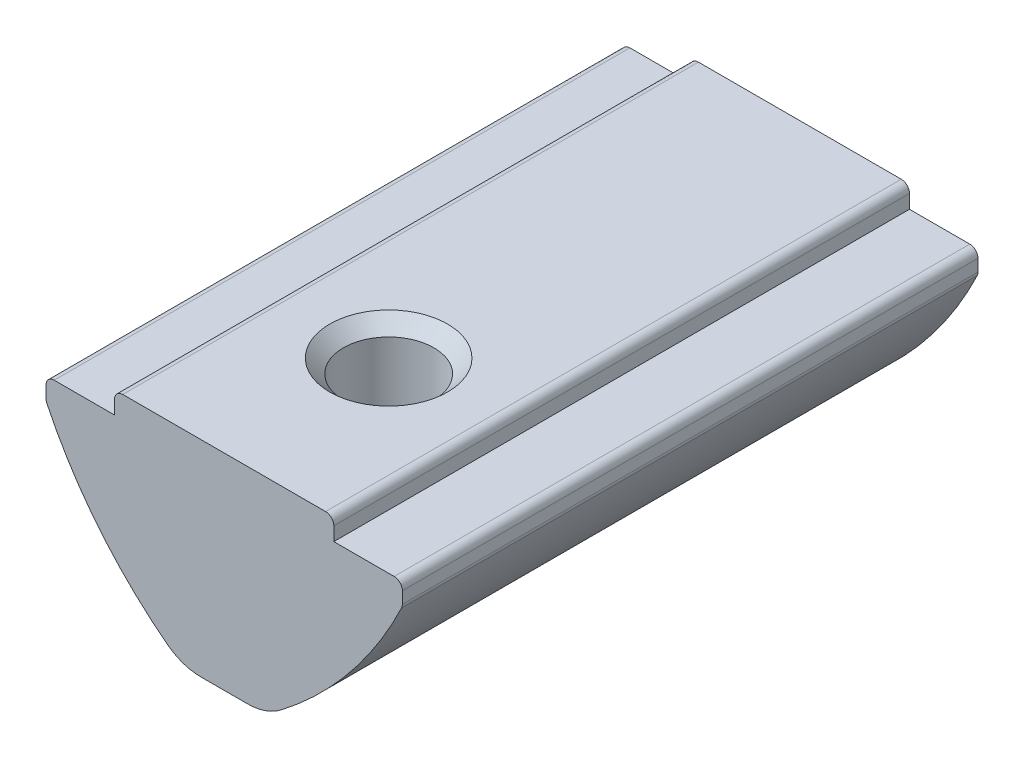
ISO-10303-21;
HEADER;
FILE_DESCRIPTION(('STEP AP214'),'2;1');
FILE_NAME('part.step','',(''),(''),'','','');
FILE_SCHEMA(('AUTOMOTIVE_DESIGN { 1 0 10303 214 1 1 1 1 }'));
ENDSEC;
DATA;
#1=APPLICATION_CONTEXT('core data for automotive mechanical design processes');
#2=APPLICATION_PROTOCOL_DEFINITION('international standard','automotive_design',2000,#1);
#3=PRODUCT_CONTEXT('',#1,'mechanical');
#4=PRODUCT('Part','Part','',(#3));
#5=PRODUCT_RELATED_PRODUCT_CATEGORY('part','',(#4));
#6=PRODUCT_DEFINITION_FORMATION('','',#4);
#7=PRODUCT_DEFINITION_CONTEXT('part definition',#1,'design');
#8=PRODUCT_DEFINITION('design','',#6,#7);
#9=PRODUCT_DEFINITION_SHAPE('','',#8);
#10=(LENGTH_UNIT() NAMED_UNIT(*) SI_UNIT(.MILLI.,.METRE.));
#11=(NAMED_UNIT(*) PLANE_ANGLE_UNIT() SI_UNIT($,.RADIAN.));
#12=(NAMED_UNIT(*) SI_UNIT($,.STERADIAN.) SOLID_ANGLE_UNIT());
#13=UNCERTAINTY_MEASURE_WITH_UNIT(LENGTH_MEASURE(1.E-05),#10,'distance_accuracy_value','');
#14=(GEOMETRIC_REPRESENTATION_CONTEXT(3) GLOBAL_UNCERTAINTY_ASSIGNED_CONTEXT((#13)) GLOBAL_UNIT_ASSIGNED_CONTEXT((#10,
#11,#12)) REPRESENTATION_CONTEXT('',''));
#15=CARTESIAN_POINT('',(0.,0.,0.));
#16=DIRECTION('',(0.,0.,1.));
#17=DIRECTION('',(1.,0.,0.));
#18=AXIS2_PLACEMENT_3D('',#15,#16,#17);
#19=CARTESIAN_POINT('',(-1.5,-7.5,10.5));
#20=DIRECTION('',(0.,1.,0.));
#21=DIRECTION('',(0.,0.,1.));
#22=AXIS2_PLACEMENT_3D('',#19,#20,#21);
#23=PLANE('',#22);
#24=DIRECTION('',(0.,0.,-1.));
#25=VECTOR('',#24,1.);
#26=CARTESIAN_POINT('',(0.84882059675723,-7.5,10.5));
#27=LINE('',#26,#25);
#28=CARTESIAN_POINT('',(0.84882059675723,-7.5,-10.5));
#29=VERTEX_POINT('',#28);
#30=CARTESIAN_POINT('',(0.84882059675723,-7.5,-7.85628300679493));
#31=VERTEX_POINT('',#30);
#32=EDGE_CURVE('E207',#29,#31,#27,.F.);
#33=ORIENTED_EDGE('',*,*,#32,.T.);
#34=CARTESIAN_POINT('',(0.,-7.5,-6.5));
#35=DIRECTION('',(0.,1.,0.));
#36=DIRECTION('',(0.,0.,1.));
#37=AXIS2_PLACEMENT_3D('',#34,#35,#36);
#38=CIRCLE('',#37,1.6);
#39=CARTESIAN_POINT('',(-0.848820596757229,-7.5,-7.85628300679494));
#40=VERTEX_POINT('',#39);
#41=EDGE_CURVE('E206',#31,#40,#38,.T.);
#42=ORIENTED_EDGE('',*,*,#41,.T.);
#43=DIRECTION('',(0.,0.,-1.));
#44=VECTOR('',#43,1.);
#45=CARTESIAN_POINT('',(-0.84882059675723,-7.5,10.5));
#46=LINE('',#45,#44);
#47=CARTESIAN_POINT('',(-0.84882059675723,-7.5,-10.5));
#48=VERTEX_POINT('',#47);
#49=EDGE_CURVE('E193',#40,#48,#46,.T.);
#50=ORIENTED_EDGE('',*,*,#49,.T.);
#51=DIRECTION('',(1.,0.,0.));
#52=VECTOR('',#51,1.);
#53=CARTESIAN_POINT('',(-1.5,-7.5,-10.5));
#54=LINE('',#53,#52);
#55=EDGE_CURVE('E299',#48,#29,#54,.T.);
#56=ORIENTED_EDGE('',*,*,#55,.T.);
#57=EDGE_LOOP('',(#33,#42,#50,#56));
#58=FACE_BOUND('',#57,.T.);
#59=ADVANCED_FACE('F37',(#58),#23,.F.);
#60=CARTESIAN_POINT('',(-0.84882059675723,-7.5,3.08507823731462));
#61=VERTEX_POINT('',#60);
#62=CARTESIAN_POINT('',(-0.84882059675723,-7.5,-5.14371699320506));
#63=VERTEX_POINT('',#62);
#64=EDGE_CURVE('E201',#61,#63,#46,.T.);
#65=ORIENTED_EDGE('',*,*,#64,.T.);
#66=CARTESIAN_POINT('',(0.84882059675723,-7.5,-5.14371699320506));
#67=VERTEX_POINT('',#66);
#68=EDGE_CURVE('E58',#63,#67,#38,.T.);
#69=ORIENTED_EDGE('',*,*,#68,.T.);
#70=CARTESIAN_POINT('',(0.84882059675723,-7.5,3.08507823731462));
#71=VERTEX_POINT('',#70);
#72=EDGE_CURVE('E377',#67,#71,#27,.F.);
#73=ORIENTED_EDGE('',*,*,#72,.T.);
#74=CARTESIAN_POINT('',(0.,-7.5,4.5));
#75=DIRECTION('',(0.,1.,0.));
#76=DIRECTION('',(0.,0.,1.));
#77=AXIS2_PLACEMENT_3D('',#74,#75,#76);
#78=CIRCLE('',#77,1.65);
#79=EDGE_CURVE('E252',#71,#61,#78,.T.);
#80=ORIENTED_EDGE('',*,*,#79,.T.);
#81=EDGE_LOOP('',(#65,#69,#73,#80));
#82=FACE_BOUND('',#81,.T.);
#83=ADVANCED_FACE('F397',(#82),#23,.F.);
#84=CARTESIAN_POINT('',(4.,0.,10.5));
#85=DIRECTION('',(-1.,0.,0.));
#86=DIRECTION('',(0.,0.,1.));
#87=AXIS2_PLACEMENT_3D('',#84,#85,#86);
#88=PLANE('',#87);
#89=DIRECTION('',(0.,1.,0.));
#90=VECTOR('',#89,1.);
#91=CARTESIAN_POINT('',(4.,0.,-10.5));
#92=LINE('',#91,#90);
#93=CARTESIAN_POINT('',(4.,-0.799999999999998,-10.5));
#94=VERTEX_POINT('',#93);
#95=CARTESIAN_POINT('',(4.,-0.3,-10.5));
#96=VERTEX_POINT('',#95);
#97=EDGE_CURVE('E251',#94,#96,#92,.T.);
#98=ORIENTED_EDGE('',*,*,#97,.T.);
#99=DIRECTION('',(0.,0.,-1.));
#100=VECTOR('',#99,1.);
#101=CARTESIAN_POINT('',(4.,-0.3,10.5));
#102=LINE('',#101,#100);
#103=CARTESIAN_POINT('',(4.,-0.3,10.5));
#104=VERTEX_POINT('',#103);
#105=EDGE_CURVE('E330',#96,#104,#102,.F.);
#106=ORIENTED_EDGE('',*,*,#105,.T.);
#107=DIRECTION('',(0.,1.,0.));
#108=VECTOR('',#107,1.);
#109=CARTESIAN_POINT('',(4.,0.,10.5));
#110=LINE('',#109,#108);
#111=CARTESIAN_POINT('',(4.,-0.799999999999998,10.5));
#112=VERTEX_POINT('',#111);
#113=EDGE_CURVE('E254',#112,#104,#110,.T.);
#114=ORIENTED_EDGE('',*,*,#113,.F.);
#115=DIRECTION('',(0.,0.,-1.));
#116=VECTOR('',#115,1.);
#117=CARTESIAN_POINT('',(4.,-0.799999999999998,10.5));
#118=LINE('',#117,#116);
#119=EDGE_CURVE('E282',#112,#94,#118,.T.);
#120=ORIENTED_EDGE('',*,*,#119,.T.);
#121=EDGE_LOOP('',(#98,#106,#114,#120));
#122=FACE_BOUND('',#121,.T.);
#123=ADVANCED_FACE('F445',(#122),#88,.F.);
#124=CARTESIAN_POINT('',(-4.,0.,10.5));
#125=DIRECTION('',(0.,-1.,0.));
#126=DIRECTION('',(0.,0.,-1.));
#127=AXIS2_PLACEMENT_3D('',#124,#125,#126);
#128=PLANE('',#127);
#129=CARTESIAN_POINT('',(0.,0.,4.5));
#130=DIRECTION('',(0.,1.,0.));
#131=DIRECTION('',(0.,0.,1.));
#132=AXIS2_PLACEMENT_3D('',#129,#130,#131);
#133=CIRCLE('',#132,2.15);
#134=CARTESIAN_POINT('',(0.,0.,6.65));
#135=VERTEX_POINT('',#134);
#136=EDGE_CURVE('E217',#135,#135,#133,.T.);
#137=ORIENTED_EDGE('',*,*,#136,.F.);
#138=EDGE_LOOP('',(#137));
#139=FACE_BOUND('',#138,.T.);
#140=DIRECTION('',(-1.,0.,0.));
#141=VECTOR('',#140,1.);
#142=CARTESIAN_POINT('',(-4.,0.,10.5));
#143=LINE('',#142,#141);
#144=CARTESIAN_POINT('',(3.7,0.,10.5));
#145=VERTEX_POINT('',#144);
#146=CARTESIAN_POINT('',(-3.7,0.,10.5));
#147=VERTEX_POINT('',#146);
#148=EDGE_CURVE('E257',#145,#147,#143,.T.);
#149=ORIENTED_EDGE('',*,*,#148,.F.);
#150=DIRECTION('',(0.,0.,-1.));
#151=VECTOR('',#150,1.);
#152=CARTESIAN_POINT('',(3.7,0.,10.5));
#153=LINE('',#152,#151);
#154=CARTESIAN_POINT('',(3.7,0.,-10.5));
#155=VERTEX_POINT('',#154);
#156=EDGE_CURVE('E314',#145,#155,#153,.T.);
#157=ORIENTED_EDGE('',*,*,#156,.T.);
#158=DIRECTION('',(-1.,0.,0.));
#159=VECTOR('',#158,1.);
#160=CARTESIAN_POINT('',(-4.,0.,-10.5));
#161=LINE('',#160,#159);
#162=CARTESIAN_POINT('',(-3.7,0.,-10.5));
#163=VERTEX_POINT('',#162);
#164=EDGE_CURVE('E285',#155,#163,#161,.T.);
#165=ORIENTED_EDGE('',*,*,#164,.T.);
#166=DIRECTION('',(0.,0.,-1.));
#167=VECTOR('',#166,1.);
#168=CARTESIAN_POINT('',(-3.7,0.,10.5));
#169=LINE('',#168,#167);
#170=EDGE_CURVE('E312',#163,#147,#169,.F.);
#171=ORIENTED_EDGE('',*,*,#170,.T.);
#172=EDGE_LOOP('',(#149,#157,#165,#171));
#173=FACE_BOUND('',#172,.T.);
#174=ADVANCED_FACE('F434',(#139,#173),#128,.F.);
#175=CARTESIAN_POINT('',(-4.,0.,10.5));
#176=DIRECTION('',(1.,0.,0.));
#177=DIRECTION('',(0.,0.,-1.));
#178=AXIS2_PLACEMENT_3D('',#175,#176,#177);
#179=PLANE('',#178);
#180=DIRECTION('',(0.,-1.,0.));
#181=VECTOR('',#180,1.);
#182=CARTESIAN_POINT('',(-4.,0.,10.5));
#183=LINE('',#182,#181);
#184=CARTESIAN_POINT('',(-4.,-0.3,10.5));
#185=VERTEX_POINT('',#184);
#186=CARTESIAN_POINT('',(-4.,-0.8,10.5));
#187=VERTEX_POINT('',#186);
#188=EDGE_CURVE('E261',#185,#187,#183,.T.);
#189=ORIENTED_EDGE('',*,*,#188,.F.);
#190=DIRECTION('',(0.,0.,-1.));
#191=VECTOR('',#190,1.);
#192=CARTESIAN_POINT('',(-4.,-0.3,10.5));
#193=LINE('',#192,#191);
#194=CARTESIAN_POINT('',(-4.,-0.3,-10.5));
#195=VERTEX_POINT('',#194);
#196=EDGE_CURVE('E344',#185,#195,#193,.T.);
#197=ORIENTED_EDGE('',*,*,#196,.T.);
#198=DIRECTION('',(0.,-1.,0.));
#199=VECTOR('',#198,1.);
#200=CARTESIAN_POINT('',(-4.,0.,-10.5));
#201=LINE('',#200,#199);
#202=CARTESIAN_POINT('',(-4.,-0.8,-10.5));
#203=VERTEX_POINT('',#202);
#204=EDGE_CURVE('E288',#195,#203,#201,.T.);
#205=ORIENTED_EDGE('',*,*,#204,.T.);
#206=DIRECTION('',(0.,0.,-1.));
#207=VECTOR('',#206,1.);
#208=CARTESIAN_POINT('',(-4.,-0.8,10.5));
#209=LINE('',#208,#207);
#210=EDGE_CURVE('E309',#187,#203,#209,.T.);
#211=ORIENTED_EDGE('',*,*,#210,.F.);
#212=EDGE_LOOP('',(#189,#197,#205,#211));
#213=FACE_BOUND('',#212,.T.);
#214=ADVANCED_FACE('F427',(#213),#179,.F.);
#215=CARTESIAN_POINT('',(-4.,-0.8,10.5));
#216=DIRECTION('',(0.,-1.,0.));
#217=DIRECTION('',(1.,0.,0.));
#218=AXIS2_PLACEMENT_3D('',#215,#216,#217);
#219=PLANE('',#218);
#220=DIRECTION('',(-1.,0.,0.));
#221=VECTOR('',#220,1.);
#222=CARTESIAN_POINT('',(-4.,-0.8,-10.5));
#223=LINE('',#222,#221);
#224=CARTESIAN_POINT('',(-6.2,-0.8,-10.5));
#225=VERTEX_POINT('',#224);
#226=EDGE_CURVE('E290',#203,#225,#223,.T.);
#227=ORIENTED_EDGE('',*,*,#226,.T.);
#228=DIRECTION('',(0.,0.,-1.));
#229=VECTOR('',#228,1.);
#230=CARTESIAN_POINT('',(-6.2,-0.8,10.5));
#231=LINE('',#230,#229);
#232=CARTESIAN_POINT('',(-6.2,-0.8,10.5));
#233=VERTEX_POINT('',#232);
#234=EDGE_CURVE('E363',#225,#233,#231,.F.);
#235=ORIENTED_EDGE('',*,*,#234,.T.);
#236=DIRECTION('',(-1.,0.,0.));
#237=VECTOR('',#236,1.);
#238=CARTESIAN_POINT('',(-4.,-0.8,10.5));
#239=LINE('',#238,#237);
#240=EDGE_CURVE('E263',#187,#233,#239,.T.);
#241=ORIENTED_EDGE('',*,*,#240,.F.);
#242=ORIENTED_EDGE('',*,*,#210,.T.);
#243=EDGE_LOOP('',(#227,#235,#241,#242));
#244=FACE_BOUND('',#243,.T.);
#245=ADVANCED_FACE('F422',(#244),#219,.F.);
#246=CARTESIAN_POINT('',(-6.5,-0.8,10.5));
#247=DIRECTION('',(1.,0.,0.));
#248=DIRECTION('',(0.,1.,0.));
#249=AXIS2_PLACEMENT_3D('',#246,#247,#248);
#250=PLANE('',#249);
#251=DIRECTION('',(0.,-1.,0.));
#252=VECTOR('',#251,1.);
#253=CARTESIAN_POINT('',(-6.5,-0.8,10.5));
#254=LINE('',#253,#252);
#255=CARTESIAN_POINT('',(-6.5,-1.1,10.5));
#256=VERTEX_POINT('',#255);
#257=CARTESIAN_POINT('',(-6.5,-1.53219657512287,10.5));
#258=VERTEX_POINT('',#257);
#259=EDGE_CURVE('E266',#256,#258,#254,.T.);
#260=ORIENTED_EDGE('',*,*,#259,.F.);
#261=DIRECTION('',(0.,0.,-1.));
#262=VECTOR('',#261,1.);
#263=CARTESIAN_POINT('',(-6.5,-1.1,10.5));
#264=LINE('',#263,#262);
#265=CARTESIAN_POINT('',(-6.5,-1.1,-10.5));
#266=VERTEX_POINT('',#265);
#267=EDGE_CURVE('E360',#256,#266,#264,.T.);
#268=ORIENTED_EDGE('',*,*,#267,.T.);
#269=DIRECTION('',(0.,-1.,0.));
#270=VECTOR('',#269,1.);
#271=CARTESIAN_POINT('',(-6.5,-0.8,-10.5));
#272=LINE('',#271,#270);
#273=CARTESIAN_POINT('',(-6.5,-1.53219657512287,-10.5));
#274=VERTEX_POINT('',#273);
#275=EDGE_CURVE('E293',#266,#274,#272,.T.);
#276=ORIENTED_EDGE('',*,*,#275,.T.);
#277=DIRECTION('',(0.,0.,-1.));
#278=VECTOR('',#277,1.);
#279=CARTESIAN_POINT('',(-6.5,-1.53219657512287,10.5));
#280=LINE('',#279,#278);
#281=EDGE_CURVE('E358',#274,#258,#280,.F.);
#282=ORIENTED_EDGE('',*,*,#281,.T.);
#283=EDGE_LOOP('',(#260,#268,#276,#282));
#284=FACE_BOUND('',#283,.T.);
#285=ADVANCED_FACE('F413',(#284),#250,.F.);
#286=CARTESIAN_POINT('',(7.05665780918356,4.82004899083352,10.5));
#287=DIRECTION('',(0.,0.,-1.));
#288=DIRECTION('',(-1.,0.,0.));
#289=AXIS2_PLACEMENT_3D('',#286,#287,#288);
#290=CYLINDRICAL_SURFACE('',#289,15.);
#291=CARTESIAN_POINT('',(7.05665780918356,4.82004899083352,-10.5));
#292=DIRECTION('',(0.,0.,1.));
#293=DIRECTION('',(1.,0.,0.));
#294=AXIS2_PLACEMENT_3D('',#291,#292,#293);
#295=CIRCLE('',#294,15.);
#296=CARTESIAN_POINT('',(-6.47054403692211,-1.66183423973423,-10.5));
#297=VERTEX_POINT('',#296);
#298=CARTESIAN_POINT('',(-2.06504804382504,-7.08769984474362,-10.5));
#299=VERTEX_POINT('',#298);
#300=EDGE_CURVE('E296',#297,#299,#295,.T.);
#301=ORIENTED_EDGE('',*,*,#300,.T.);
#302=DIRECTION('',(0.,0.,-1.));
#303=VECTOR('',#302,1.);
#304=CARTESIAN_POINT('',(-2.06504804382504,-7.08769984474362,10.5));
#305=LINE('',#304,#303);
#306=CARTESIAN_POINT('',(-2.06504804382504,-7.08769984474362,10.5));
#307=VERTEX_POINT('',#306);
#308=EDGE_CURVE('E380',#299,#307,#305,.F.);
#309=ORIENTED_EDGE('',*,*,#308,.T.);
#310=CARTESIAN_POINT('',(7.05665780918356,4.82004899083352,10.5));
#311=DIRECTION('',(0.,0.,1.));
#312=DIRECTION('',(1.,0.,0.));
#313=AXIS2_PLACEMENT_3D('',#310,#311,#312);
#314=CIRCLE('',#313,15.);
#315=CARTESIAN_POINT('',(-6.47054403692211,-1.66183423973423,10.5));
#316=VERTEX_POINT('',#315);
#317=EDGE_CURVE('E269',#316,#307,#314,.T.);
#318=ORIENTED_EDGE('',*,*,#317,.F.);
#319=DIRECTION('',(0.,0.,-1.));
#320=VECTOR('',#319,1.);
#321=CARTESIAN_POINT('',(-6.47054403692211,-1.66183423973423,10.5));
#322=LINE('',#321,#320);
#323=EDGE_CURVE('E365',#316,#297,#322,.T.);
#324=ORIENTED_EDGE('',*,*,#323,.T.);
#325=EDGE_LOOP('',(#301,#309,#318,#324));
#326=FACE_BOUND('',#325,.T.);
#327=ADVANCED_FACE('F402',(#326),#290,.T.);
#328=CARTESIAN_POINT('',(-0.84882059675723,-7.5,10.5));
#329=VERTEX_POINT('',#328);
#330=CARTESIAN_POINT('',(-0.84882059675723,-7.5,5.91492176268538));
#331=VERTEX_POINT('',#330);
#332=EDGE_CURVE('E204',#329,#331,#46,.T.);
#333=ORIENTED_EDGE('',*,*,#332,.T.);
#334=CARTESIAN_POINT('',(0.84882059675723,-7.5,5.91492176268538));
#335=VERTEX_POINT('',#334);
#336=EDGE_CURVE('E253',#331,#335,#78,.T.);
#337=ORIENTED_EDGE('',*,*,#336,.T.);
#338=CARTESIAN_POINT('',(0.84882059675723,-7.5,10.5));
#339=VERTEX_POINT('',#338);
#340=EDGE_CURVE('E374',#335,#339,#27,.F.);
#341=ORIENTED_EDGE('',*,*,#340,.T.);
#342=DIRECTION('',(1.,0.,0.));
#343=VECTOR('',#342,1.);
#344=CARTESIAN_POINT('',(-1.5,-7.5,10.5));
#345=LINE('',#344,#343);
#346=EDGE_CURVE('E272',#329,#339,#345,.T.);
#347=ORIENTED_EDGE('',*,*,#346,.F.);
#348=EDGE_LOOP('',(#333,#337,#341,#347));
#349=FACE_BOUND('',#348,.T.);
#350=ADVANCED_FACE('F391',(#349),#23,.F.);
#351=CARTESIAN_POINT('',(-7.05665780918356,4.82004899083352,10.5));
#352=DIRECTION('',(0.,0.,-1.));
#353=DIRECTION('',(-1.,0.,0.));
#354=AXIS2_PLACEMENT_3D('',#351,#352,#353);
#355=CYLINDRICAL_SURFACE('',#354,15.);
#356=CARTESIAN_POINT('',(-7.05665780918356,4.82004899083352,10.5));
#357=DIRECTION('',(0.,0.,1.));
#358=DIRECTION('',(1.,0.,0.));
#359=AXIS2_PLACEMENT_3D('',#356,#357,#358);
#360=CIRCLE('',#359,15.);
#361=CARTESIAN_POINT('',(2.06504804382504,-7.08769984474362,10.5));
#362=VERTEX_POINT('',#361);
#363=CARTESIAN_POINT('',(6.47054403692211,-1.66183423973423,10.5));
#364=VERTEX_POINT('',#363);
#365=EDGE_CURVE('E275',#362,#364,#360,.T.);
#366=ORIENTED_EDGE('',*,*,#365,.F.);
#367=DIRECTION('',(0.,0.,-1.));
#368=VECTOR('',#367,1.);
#369=CARTESIAN_POINT('',(2.06504804382504,-7.08769984474362,10.5));
#370=LINE('',#369,#368);
#371=CARTESIAN_POINT('',(2.06504804382504,-7.08769984474362,-10.5));
#372=VERTEX_POINT('',#371);
#373=EDGE_CURVE('E368',#362,#372,#370,.T.);
#374=ORIENTED_EDGE('',*,*,#373,.T.);
#375=CARTESIAN_POINT('',(-7.05665780918356,4.82004899083352,-10.5));
#376=DIRECTION('',(0.,0.,1.));
#377=DIRECTION('',(1.,0.,0.));
#378=AXIS2_PLACEMENT_3D('',#375,#376,#377);
#379=CIRCLE('',#378,15.);
#380=CARTESIAN_POINT('',(6.47054403692211,-1.66183423973423,-10.5));
#381=VERTEX_POINT('',#380);
#382=EDGE_CURVE('E301',#372,#381,#379,.T.);
#383=ORIENTED_EDGE('',*,*,#382,.T.);
#384=DIRECTION('',(0.,0.,-1.));
#385=VECTOR('',#384,1.);
#386=CARTESIAN_POINT('',(6.47054403692211,-1.66183423973423,10.5));
#387=LINE('',#386,#385);
#388=EDGE_CURVE('E352',#381,#364,#387,.F.);
#389=ORIENTED_EDGE('',*,*,#388,.T.);
#390=EDGE_LOOP('',(#366,#374,#383,#389));
#391=FACE_BOUND('',#390,.T.);
#392=ADVANCED_FACE('F467',(#391),#355,.T.);
#393=CARTESIAN_POINT('',(6.5,-0.8,10.5));
#394=DIRECTION('',(-1.,0.,0.));
#395=DIRECTION('',(0.,-1.,0.));
#396=AXIS2_PLACEMENT_3D('',#393,#394,#395);
#397=PLANE('',#396);
#398=DIRECTION('',(0.,1.,0.));
#399=VECTOR('',#398,1.);
#400=CARTESIAN_POINT('',(6.5,-0.8,10.5));
#401=LINE('',#400,#399);
#402=CARTESIAN_POINT('',(6.5,-1.53219657512287,10.5));
#403=VERTEX_POINT('',#402);
#404=CARTESIAN_POINT('',(6.5,-1.1,10.5));
#405=VERTEX_POINT('',#404);
#406=EDGE_CURVE('E277',#403,#405,#401,.T.);
#407=ORIENTED_EDGE('',*,*,#406,.F.);
#408=DIRECTION('',(0.,0.,-1.));
#409=VECTOR('',#408,1.);
#410=CARTESIAN_POINT('',(6.5,-1.53219657512287,10.5));
#411=LINE('',#410,#409);
#412=CARTESIAN_POINT('',(6.5,-1.53219657512287,-10.5));
#413=VERTEX_POINT('',#412);
#414=EDGE_CURVE('E349',#403,#413,#411,.T.);
#415=ORIENTED_EDGE('',*,*,#414,.T.);
#416=DIRECTION('',(0.,1.,0.));
#417=VECTOR('',#416,1.);
#418=CARTESIAN_POINT('',(6.5,-0.8,-10.5));
#419=LINE('',#418,#417);
#420=CARTESIAN_POINT('',(6.5,-1.1,-10.5));
#421=VERTEX_POINT('',#420);
#422=EDGE_CURVE('E303',#413,#421,#419,.T.);
#423=ORIENTED_EDGE('',*,*,#422,.T.);
#424=DIRECTION('',(0.,0.,-1.));
#425=VECTOR('',#424,1.);
#426=CARTESIAN_POINT('',(6.5,-1.1,10.5));
#427=LINE('',#426,#425);
#428=EDGE_CURVE('E347',#421,#405,#427,.F.);
#429=ORIENTED_EDGE('',*,*,#428,.T.);
#430=EDGE_LOOP('',(#407,#415,#423,#429));
#431=FACE_BOUND('',#430,.T.);
#432=ADVANCED_FACE('F457',(#431),#397,.F.);
#433=CARTESIAN_POINT('',(4.,-0.799999999999998,10.5));
#434=DIRECTION('',(0.,-1.,0.));
#435=DIRECTION('',(1.,0.,0.));
#436=AXIS2_PLACEMENT_3D('',#433,#434,#435);
#437=PLANE('',#436);
#438=DIRECTION('',(-1.,0.,0.));
#439=VECTOR('',#438,1.);
#440=CARTESIAN_POINT('',(4.,-0.799999999999998,10.5));
#441=LINE('',#440,#439);
#442=CARTESIAN_POINT('',(6.2,-0.8,10.5));
#443=VERTEX_POINT('',#442);
#444=EDGE_CURVE('E280',#443,#112,#441,.T.);
#445=ORIENTED_EDGE('',*,*,#444,.F.);
#446=DIRECTION('',(0.,0.,-1.));
#447=VECTOR('',#446,1.);
#448=CARTESIAN_POINT('',(6.2,-0.8,10.5));
#449=LINE('',#448,#447);
#450=CARTESIAN_POINT('',(6.2,-0.8,-10.5));
#451=VERTEX_POINT('',#450);
#452=EDGE_CURVE('E355',#443,#451,#449,.T.);
#453=ORIENTED_EDGE('',*,*,#452,.T.);
#454=DIRECTION('',(-1.,0.,0.));
#455=VECTOR('',#454,1.);
#456=CARTESIAN_POINT('',(4.,-0.799999999999998,-10.5));
#457=LINE('',#456,#455);
#458=EDGE_CURVE('E258',#451,#94,#457,.T.);
#459=ORIENTED_EDGE('',*,*,#458,.T.);
#460=ORIENTED_EDGE('',*,*,#119,.F.);
#461=EDGE_LOOP('',(#445,#453,#459,#460));
#462=FACE_BOUND('',#461,.T.);
#463=ADVANCED_FACE('F450',(#462),#437,.F.);
#464=CARTESIAN_POINT('',(-7.05665780918356,4.82004899083352,10.5));
#465=DIRECTION('',(0.,0.,1.));
#466=DIRECTION('',(1.,0.,0.));
#467=AXIS2_PLACEMENT_3D('',#464,#465,#466);
#468=PLANE('',#467);
#469=ORIENTED_EDGE('',*,*,#346,.T.);
#470=CARTESIAN_POINT('',(0.84882059675723,-5.5,10.5));
#471=DIRECTION('',(0.,0.,1.));
#472=DIRECTION('',(1.,0.,0.));
#473=AXIS2_PLACEMENT_3D('',#470,#471,#472);
#474=CIRCLE('',#473,2.);
#475=EDGE_CURVE('E379',#339,#362,#474,.T.);
#476=ORIENTED_EDGE('',*,*,#475,.T.);
#477=ORIENTED_EDGE('',*,*,#365,.T.);
#478=CARTESIAN_POINT('',(6.2,-1.53219657512287,10.5));
#479=DIRECTION('',(0.,0.,1.));
#480=DIRECTION('',(1.,0.,0.));
#481=AXIS2_PLACEMENT_3D('',#478,#479,#480);
#482=CIRCLE('',#481,0.3);
#483=EDGE_CURVE('E338',#364,#403,#482,.T.);
#484=ORIENTED_EDGE('',*,*,#483,.T.);
#485=ORIENTED_EDGE('',*,*,#406,.T.);
#486=CARTESIAN_POINT('',(6.2,-1.1,10.5));
#487=DIRECTION('',(0.,0.,1.));
#488=DIRECTION('',(1.,0.,0.));
#489=AXIS2_PLACEMENT_3D('',#486,#487,#488);
#490=CIRCLE('',#489,0.3);
#491=EDGE_CURVE('E336',#405,#443,#490,.T.);
#492=ORIENTED_EDGE('',*,*,#491,.T.);
#493=ORIENTED_EDGE('',*,*,#444,.T.);
#494=ORIENTED_EDGE('',*,*,#113,.T.);
#495=CARTESIAN_POINT('',(3.7,-0.3,10.5));
#496=DIRECTION('',(0.,0.,1.));
#497=DIRECTION('',(1.,0.,0.));
#498=AXIS2_PLACEMENT_3D('',#495,#496,#497);
#499=CIRCLE('',#498,0.3);
#500=EDGE_CURVE('E342',#104,#145,#499,.T.);
#501=ORIENTED_EDGE('',*,*,#500,.T.);
#502=ORIENTED_EDGE('',*,*,#148,.T.);
#503=CARTESIAN_POINT('',(-3.7,-0.3,10.5));
#504=DIRECTION('',(0.,0.,1.));
#505=DIRECTION('',(1.,0.,0.));
#506=AXIS2_PLACEMENT_3D('',#503,#504,#505);
#507=CIRCLE('',#506,0.3);
#508=EDGE_CURVE('E340',#147,#185,#507,.T.);
#509=ORIENTED_EDGE('',*,*,#508,.T.);
#510=ORIENTED_EDGE('',*,*,#188,.T.);
#511=ORIENTED_EDGE('',*,*,#240,.T.);
#512=CARTESIAN_POINT('',(-6.2,-1.1,10.5));
#513=DIRECTION('',(0.,0.,1.));
#514=DIRECTION('',(1.,0.,0.));
#515=AXIS2_PLACEMENT_3D('',#512,#513,#514);
#516=CIRCLE('',#515,0.3);
#517=EDGE_CURVE('E334',#233,#256,#516,.T.);
#518=ORIENTED_EDGE('',*,*,#517,.T.);
#519=ORIENTED_EDGE('',*,*,#259,.T.);
#520=CARTESIAN_POINT('',(-6.2,-1.53219657512287,10.5));
#521=DIRECTION('',(0.,0.,1.));
#522=DIRECTION('',(1.,0.,0.));
#523=AXIS2_PLACEMENT_3D('',#520,#521,#522);
#524=CIRCLE('',#523,0.3);
#525=EDGE_CURVE('E332',#258,#316,#524,.T.);
#526=ORIENTED_EDGE('',*,*,#525,.T.);
#527=ORIENTED_EDGE('',*,*,#317,.T.);
#528=CARTESIAN_POINT('',(-0.84882059675723,-5.5,10.5));
#529=DIRECTION('',(0.,0.,1.));
#530=DIRECTION('',(1.,0.,0.));
#531=AXIS2_PLACEMENT_3D('',#528,#529,#530);
#532=CIRCLE('',#531,2.);
#533=EDGE_CURVE('E376',#307,#329,#532,.T.);
#534=ORIENTED_EDGE('',*,*,#533,.T.);
#535=EDGE_LOOP('',(#469,#476,#477,#484,#485,#492,#493,#494,#501,#502,#509,#510,#511,#518,#519,
#526,#527,#534));
#536=FACE_BOUND('',#535,.T.);
#537=ADVANCED_FACE('F235',(#536),#468,.T.);
#538=CARTESIAN_POINT('',(-7.05665780918356,4.82004899083352,-10.5));
#539=DIRECTION('',(0.,0.,1.));
#540=DIRECTION('',(1.,0.,0.));
#541=AXIS2_PLACEMENT_3D('',#538,#539,#540);
#542=PLANE('',#541);
#543=ORIENTED_EDGE('',*,*,#382,.F.);
#544=CARTESIAN_POINT('',(0.84882059675723,-5.5,-10.5));
#545=DIRECTION('',(0.,0.,1.));
#546=DIRECTION('',(1.,0.,0.));
#547=AXIS2_PLACEMENT_3D('',#544,#545,#546);
#548=CIRCLE('',#547,2.);
#549=EDGE_CURVE('E202',#372,#29,#548,.F.);
#550=ORIENTED_EDGE('',*,*,#549,.T.);
#551=ORIENTED_EDGE('',*,*,#55,.F.);
#552=CARTESIAN_POINT('',(-0.84882059675723,-5.5,-10.5));
#553=DIRECTION('',(0.,0.,1.));
#554=DIRECTION('',(1.,0.,0.));
#555=AXIS2_PLACEMENT_3D('',#552,#553,#554);
#556=CIRCLE('',#555,2.);
#557=EDGE_CURVE('E197',#48,#299,#556,.F.);
#558=ORIENTED_EDGE('',*,*,#557,.T.);
#559=ORIENTED_EDGE('',*,*,#300,.F.);
#560=CARTESIAN_POINT('',(-6.2,-1.53219657512287,-10.5));
#561=DIRECTION('',(0.,0.,1.));
#562=DIRECTION('',(1.,0.,0.));
#563=AXIS2_PLACEMENT_3D('',#560,#561,#562);
#564=CIRCLE('',#563,0.3);
#565=EDGE_CURVE('E317',#297,#274,#564,.F.);
#566=ORIENTED_EDGE('',*,*,#565,.T.);
#567=ORIENTED_EDGE('',*,*,#275,.F.);
#568=CARTESIAN_POINT('',(-6.2,-1.1,-10.5));
#569=DIRECTION('',(0.,0.,1.));
#570=DIRECTION('',(1.,0.,0.));
#571=AXIS2_PLACEMENT_3D('',#568,#569,#570);
#572=CIRCLE('',#571,0.3);
#573=EDGE_CURVE('E319',#266,#225,#572,.F.);
#574=ORIENTED_EDGE('',*,*,#573,.T.);
#575=ORIENTED_EDGE('',*,*,#226,.F.);
#576=ORIENTED_EDGE('',*,*,#204,.F.);
#577=CARTESIAN_POINT('',(-3.7,-0.3,-10.5));
#578=DIRECTION('',(0.,0.,1.));
#579=DIRECTION('',(1.,0.,0.));
#580=AXIS2_PLACEMENT_3D('',#577,#578,#579);
#581=CIRCLE('',#580,0.3);
#582=EDGE_CURVE('E326',#195,#163,#581,.F.);
#583=ORIENTED_EDGE('',*,*,#582,.T.);
#584=ORIENTED_EDGE('',*,*,#164,.F.);
#585=CARTESIAN_POINT('',(3.7,-0.3,-10.5));
#586=DIRECTION('',(0.,0.,1.));
#587=DIRECTION('',(1.,0.,0.));
#588=AXIS2_PLACEMENT_3D('',#585,#586,#587);
#589=CIRCLE('',#588,0.3);
#590=EDGE_CURVE('E328',#155,#96,#589,.F.);
#591=ORIENTED_EDGE('',*,*,#590,.T.);
#592=ORIENTED_EDGE('',*,*,#97,.F.);
#593=ORIENTED_EDGE('',*,*,#458,.F.);
#594=CARTESIAN_POINT('',(6.2,-1.1,-10.5));
#595=DIRECTION('',(0.,0.,1.));
#596=DIRECTION('',(1.,0.,0.));
#597=AXIS2_PLACEMENT_3D('',#594,#595,#596);
#598=CIRCLE('',#597,0.3);
#599=EDGE_CURVE('E321',#451,#421,#598,.F.);
#600=ORIENTED_EDGE('',*,*,#599,.T.);
#601=ORIENTED_EDGE('',*,*,#422,.F.);
#602=CARTESIAN_POINT('',(6.2,-1.53219657512287,-10.5));
#603=DIRECTION('',(0.,0.,1.));
#604=DIRECTION('',(1.,0.,0.));
#605=AXIS2_PLACEMENT_3D('',#602,#603,#604);
#606=CIRCLE('',#605,0.3);
#607=EDGE_CURVE('E323',#413,#381,#606,.F.);
#608=ORIENTED_EDGE('',*,*,#607,.T.);
#609=EDGE_LOOP('',(#543,#550,#551,#558,#559,#566,#567,#574,#575,#576,#583,#584,#591,#592,#593,
#600,#601,#608));
#610=FACE_BOUND('',#609,.T.);
#611=ADVANCED_FACE('F410',(#610),#542,.F.);
#612=CARTESIAN_POINT('',(3.7,-0.3,10.5));
#613=DIRECTION('',(0.,0.,-1.));
#614=DIRECTION('',(-1.,0.,0.));
#615=AXIS2_PLACEMENT_3D('',#612,#613,#614);
#616=CYLINDRICAL_SURFACE('',#615,0.3);
#617=ORIENTED_EDGE('',*,*,#500,.F.);
#618=ORIENTED_EDGE('',*,*,#105,.F.);
#619=ORIENTED_EDGE('',*,*,#590,.F.);
#620=ORIENTED_EDGE('',*,*,#156,.F.);
#621=EDGE_LOOP('',(#617,#618,#619,#620));
#622=FACE_BOUND('',#621,.T.);
#623=ADVANCED_FACE('F440',(#622),#616,.T.);
#624=CARTESIAN_POINT('',(-3.7,-0.3,10.5));
#625=DIRECTION('',(0.,0.,-1.));
#626=DIRECTION('',(-1.,0.,0.));
#627=AXIS2_PLACEMENT_3D('',#624,#625,#626);
#628=CYLINDRICAL_SURFACE('',#627,0.3);
#629=ORIENTED_EDGE('',*,*,#508,.F.);
#630=ORIENTED_EDGE('',*,*,#170,.F.);
#631=ORIENTED_EDGE('',*,*,#582,.F.);
#632=ORIENTED_EDGE('',*,*,#196,.F.);
#633=EDGE_LOOP('',(#629,#630,#631,#632));
#634=FACE_BOUND('',#633,.T.);
#635=ADVANCED_FACE('F437',(#634),#628,.T.);
#636=CARTESIAN_POINT('',(6.2,-1.53219657512287,10.5));
#637=DIRECTION('',(0.,0.,-1.));
#638=DIRECTION('',(-1.,0.,0.));
#639=AXIS2_PLACEMENT_3D('',#636,#637,#638);
#640=CYLINDRICAL_SURFACE('',#639,0.3);
#641=ORIENTED_EDGE('',*,*,#483,.F.);
#642=ORIENTED_EDGE('',*,*,#388,.F.);
#643=ORIENTED_EDGE('',*,*,#607,.F.);
#644=ORIENTED_EDGE('',*,*,#414,.F.);
#645=EDGE_LOOP('',(#641,#642,#643,#644));
#646=FACE_BOUND('',#645,.T.);
#647=ADVANCED_FACE('F463',(#646),#640,.T.);
#648=CARTESIAN_POINT('',(6.2,-1.1,10.5));
#649=DIRECTION('',(0.,0.,-1.));
#650=DIRECTION('',(-1.,0.,0.));
#651=AXIS2_PLACEMENT_3D('',#648,#649,#650);
#652=CYLINDRICAL_SURFACE('',#651,0.3);
#653=ORIENTED_EDGE('',*,*,#491,.F.);
#654=ORIENTED_EDGE('',*,*,#428,.F.);
#655=ORIENTED_EDGE('',*,*,#599,.F.);
#656=ORIENTED_EDGE('',*,*,#452,.F.);
#657=EDGE_LOOP('',(#653,#654,#655,#656));
#658=FACE_BOUND('',#657,.T.);
#659=ADVANCED_FACE('F460',(#658),#652,.T.);
#660=CARTESIAN_POINT('',(-6.2,-1.1,10.5));
#661=DIRECTION('',(0.,0.,-1.));
#662=DIRECTION('',(-1.,0.,0.));
#663=AXIS2_PLACEMENT_3D('',#660,#661,#662);
#664=CYLINDRICAL_SURFACE('',#663,0.3);
#665=ORIENTED_EDGE('',*,*,#517,.F.);
#666=ORIENTED_EDGE('',*,*,#234,.F.);
#667=ORIENTED_EDGE('',*,*,#573,.F.);
#668=ORIENTED_EDGE('',*,*,#267,.F.);
#669=EDGE_LOOP('',(#665,#666,#667,#668));
#670=FACE_BOUND('',#669,.T.);
#671=ADVANCED_FACE('F417',(#670),#664,.T.);
#672=CARTESIAN_POINT('',(-6.2,-1.53219657512287,10.5));
#673=DIRECTION('',(0.,0.,-1.));
#674=DIRECTION('',(-1.,0.,0.));
#675=AXIS2_PLACEMENT_3D('',#672,#673,#674);
#676=CYLINDRICAL_SURFACE('',#675,0.3);
#677=ORIENTED_EDGE('',*,*,#525,.F.);
#678=ORIENTED_EDGE('',*,*,#281,.F.);
#679=ORIENTED_EDGE('',*,*,#565,.F.);
#680=ORIENTED_EDGE('',*,*,#323,.F.);
#681=EDGE_LOOP('',(#677,#678,#679,#680));
#682=FACE_BOUND('',#681,.T.);
#683=ADVANCED_FACE('F405',(#682),#676,.T.);
#684=CARTESIAN_POINT('',(0.84882059675723,-5.5,10.5));
#685=DIRECTION('',(0.,0.,-1.));
#686=DIRECTION('',(-1.,0.,0.));
#687=AXIS2_PLACEMENT_3D('',#684,#685,#686);
#688=CYLINDRICAL_SURFACE('',#687,2.);
#689=CARTESIAN_POINT('',(0.84862059675723,-7.49999999,-7.85640816377645));
#690=CARTESIAN_POINT('',(0.893920417374782,-7.50001597939785,-7.8280592684681));
#691=CARTESIAN_POINT('',(0.938411665543847,-7.49847031841211,-7.79842689878497));
#692=CARTESIAN_POINT('',(1.02536727830624,-7.49266619763591,-7.73653629985861));
#693=CARTESIAN_POINT('',(1.06783093828147,-7.48840680205097,-7.70427716816043));
#694=CARTESIAN_POINT('',(1.15058196715608,-7.47754793031724,-7.6368555778903));
#695=CARTESIAN_POINT('',(1.19085178101182,-7.47093208484472,-7.60167416463615));
#696=CARTESIAN_POINT('',(1.26841717204776,-7.45588891376005,-7.52856062565786));
#697=CARTESIAN_POINT('',(1.30571349778757,-7.44746204604972,-7.49062919685565));
#698=CARTESIAN_POINT('',(1.40067310000399,-7.42332855740688,-7.38560855277116));
#699=CARTESIAN_POINT('',(1.45530041175114,-7.40651913912559,-7.31596680712418));
#700=CARTESIAN_POINT('',(1.5522751278968,-7.37290832688577,-7.16881784766621));
#701=CARTESIAN_POINT('',(1.5946663503423,-7.35610712492865,-7.09134007625989));
#702=CARTESIAN_POINT('',(1.65589549983113,-7.33015326755531,-6.94877214621567));
#703=CARTESIAN_POINT('',(1.67795236402968,-7.32013387735502,-6.88523527892405));
#704=CARTESIAN_POINT('',(1.71204388562128,-7.30421907875782,-6.75501510305133));
#705=CARTESIAN_POINT('',(1.72408787769395,-7.29831983010756,-6.68833478644209));
#706=CARTESIAN_POINT('',(1.73724099236442,-7.29186203768552,-6.55328204142559));
#707=CARTESIAN_POINT('',(1.73829597266998,-7.29132993798517,-6.4849028971221));
#708=CARTESIAN_POINT('',(1.72923200837907,-7.29579993929629,-6.34907134443056));
#709=CARTESIAN_POINT('',(1.71910897628651,-7.3008040647565,-6.28161928418645));
#710=CARTESIAN_POINT('',(1.68954026321085,-7.31478083529031,-6.1539808806465));
#711=CARTESIAN_POINT('',(1.67074609314059,-7.32347318191401,-6.09360764637342));
#712=CARTESIAN_POINT('',(1.62523242319015,-7.34331257713247,-5.97638038903274));
#713=CARTESIAN_POINT('',(1.59850827832768,-7.35446106342243,-5.91952845222215));
#714=CARTESIAN_POINT('',(1.52205364552012,-7.38393190387619,-5.78026769251063));
#715=CARTESIAN_POINT('',(1.46767727087186,-7.40288997520653,-5.70054226201118));
#716=CARTESIAN_POINT('',(1.34636969879211,-7.43815652252946,-5.55050079201886));
#717=CARTESIAN_POINT('',(1.27940762800804,-7.45445829488339,-5.48020863549001));
#718=CARTESIAN_POINT('',(1.15252276724061,-7.47760241382482,-5.36393427702477));
#719=CARTESIAN_POINT('',(1.09453123398406,-7.48575872197645,-5.3160819467077));
#720=CARTESIAN_POINT('',(0.9744204443337,-7.49697001250135,-5.22586136069651));
#721=CARTESIAN_POINT('',(0.912322946277686,-7.50004994530099,-5.18346723243056));
#722=CARTESIAN_POINT('',(0.848620596757229,-7.49999999,-5.14359183622355));
#723=B_SPLINE_CURVE_WITH_KNOTS('',3,(#689,#690,#691,#692,#693,#694,#695,#696,#697,#698,#699,
#700,#701,#702,#703,#704,#705,#706,#707,#708,#709,#710,#711,#712,#713,#714,#715,#716,#717,#718,
#719,#720,#721,#722),.UNSPECIFIED.,.F.,.F.,(4,2,2,2,2,2,2,2,2,2,2,2,2,2,2,2,4),(0.,
0.160266074880731,0.320587445272624,0.48204495015916,0.64346167979442,0.912696961225026,
1.18095578400885,1.3841500199578,1.5871546113343,1.79115892549288,1.99523786320989,
2.18599856740732,2.37687123099049,2.67031292573039,2.96448407161075,3.19089694141928,
3.41619363507759),.UNSPECIFIED.);
#724=EDGE_CURVE('E65',#31,#67,#723,.T.);
#725=ORIENTED_EDGE('',*,*,#724,.F.);
#726=ORIENTED_EDGE('',*,*,#32,.F.);
#727=ORIENTED_EDGE('',*,*,#549,.F.);
#728=ORIENTED_EDGE('',*,*,#373,.F.);
#729=ORIENTED_EDGE('',*,*,#475,.F.);
#730=ORIENTED_EDGE('',*,*,#340,.F.);
#731=CARTESIAN_POINT('',(0.84882059675723,-7.5,3.08507823731462));
#732=CARTESIAN_POINT('',(0.887390023804728,-7.50000259256002,3.10821267948385));
#733=CARTESIAN_POINT('',(0.924977378768088,-7.49888413664447,3.13291044184908));
#734=CARTESIAN_POINT('',(0.997916258310032,-7.49476849509872,3.18520960843962));
#735=CARTESIAN_POINT('',(1.03326981783542,-7.49177304735136,3.21280830707414));
#736=CARTESIAN_POINT('',(1.13537105501891,-7.48054536144948,3.29943064116554));
#737=CARTESIAN_POINT('',(1.19850937728075,-7.47006525202443,3.36249170946927));
#738=CARTESIAN_POINT('',(1.31339438022379,-7.44617994355695,3.49733552311689));
#739=CARTESIAN_POINT('',(1.36517313657303,-7.43278319924659,3.56909279875343));
#740=CARTESIAN_POINT('',(1.45669295407421,-7.40598201691369,3.72003848454571));
#741=CARTESIAN_POINT('',(1.49641987070067,-7.39257758820798,3.79923548465313));
#742=CARTESIAN_POINT('',(1.56480246572416,-7.36782828598723,3.96830948257724));
#743=CARTESIAN_POINT('',(1.59264974631359,-7.35665549803212,4.05854225284587));
#744=CARTESIAN_POINT('',(1.63256668151497,-7.34016933832981,4.24290278706698));
#745=CARTESIAN_POINT('',(1.64465342269105,-7.33484962203781,4.33702621856503));
#746=CARTESIAN_POINT('',(1.65225424274016,-7.33153107623045,4.52001943054855));
#747=CARTESIAN_POINT('',(1.64877924716072,-7.33308559565623,4.60884001347181));
#748=CARTESIAN_POINT('',(1.62769826741966,-7.34213900556134,4.78447296311287));
#749=CARTESIAN_POINT('',(1.61008964822334,-7.34963900449663,4.87128495224854));
#750=CARTESIAN_POINT('',(1.56207811731873,-7.36866335024335,5.03830639627226));
#751=CARTESIAN_POINT('',(1.53201986261584,-7.38007796117703,5.11862884767385));
#752=CARTESIAN_POINT('',(1.45996147975962,-7.40471840953387,5.27350895327818));
#753=CARTESIAN_POINT('',(1.41794856880918,-7.41794617782879,5.3480603274895));
#754=CARTESIAN_POINT('',(1.31878512621521,-7.44473486003139,5.4959415014929));
#755=CARTESIAN_POINT('',(1.26064890877848,-7.45822791188522,5.56862441974819));
#756=CARTESIAN_POINT('',(1.13263773664958,-7.48081734909946,5.70341855362395));
#757=CARTESIAN_POINT('',(1.06279636493805,-7.48992603199425,5.76555901811129));
#758=CARTESIAN_POINT('',(0.965732333212009,-7.49670705381979,5.8381511791721));
#759=CARTESIAN_POINT('',(0.942903942562964,-7.49792145729331,5.8543329239191));
#760=CARTESIAN_POINT('',(0.896449397571055,-7.49956746348206,5.88551730801747));
#761=CARTESIAN_POINT('',(0.872823749981786,-7.49999955424905,5.90052067691431));
#762=CARTESIAN_POINT('',(0.84882059675723,-7.5,5.91492176268538));
#763=B_SPLINE_CURVE_WITH_KNOTS('',3,(#731,#732,#733,#734,#735,#736,#737,#738,#739,#740,#741,
#742,#743,#744,#745,#746,#747,#748,#749,#750,#751,#752,#753,#754,#755,#756,#757,#758,#759,#760,
#761,#762),.UNSPECIFIED.,.F.,.F.,(4,2,2,2,2,2,2,2,2,2,2,2,2,2,2,4),(0.,0.134809636373268,
0.269494638279873,0.5376554974992,0.805049124459148,1.07275537197653,1.356542695369,
1.64002209827646,1.90536292371512,2.17075323007589,2.42924141453699,2.68800703895061,
2.96884980221723,3.2489001834753,3.33288943080341,3.41682626271958),.UNSPECIFIED.);
#764=EDGE_CURVE('E51',#71,#335,#763,.T.);
#765=ORIENTED_EDGE('',*,*,#764,.F.);
#766=ORIENTED_EDGE('',*,*,#72,.F.);
#767=EDGE_LOOP('',(#725,#726,#727,#728,#729,#730,#765,#766));
#768=FACE_BOUND('',#767,.T.);
#769=ADVANCED_FACE('F219',(#768),#688,.T.);
#770=CARTESIAN_POINT('',(-0.84882059675723,-5.5,10.5));
#771=DIRECTION('',(0.,0.,-1.));
#772=DIRECTION('',(-1.,0.,0.));
#773=AXIS2_PLACEMENT_3D('',#770,#771,#772);
#774=CYLINDRICAL_SURFACE('',#773,2.);
#775=CARTESIAN_POINT('',(-0.84862059675723,-7.49999999,-5.14359183622355));
#776=CARTESIAN_POINT('',(-0.893920417374782,-7.50001597939785,-5.1719407315319));
#777=CARTESIAN_POINT('',(-0.938411665543847,-7.49847031841211,-5.20157310121503));
#778=CARTESIAN_POINT('',(-1.02536727830624,-7.49266619763591,-5.26346370014139));
#779=CARTESIAN_POINT('',(-1.06783093828147,-7.48840680205097,-5.29572283183958));
#780=CARTESIAN_POINT('',(-1.15058196715608,-7.47754793031724,-5.3631444221097));
#781=CARTESIAN_POINT('',(-1.19085178101182,-7.47093208484472,-5.39832583536386));
#782=CARTESIAN_POINT('',(-1.26841717204776,-7.45588891376005,-5.47143937434215));
#783=CARTESIAN_POINT('',(-1.30571349778757,-7.44746204604972,-5.50937080314435));
#784=CARTESIAN_POINT('',(-1.400673100004,-7.42332855740688,-5.61439144722884));
#785=CARTESIAN_POINT('',(-1.45530041175115,-7.40651913912559,-5.68403319287582));
#786=CARTESIAN_POINT('',(-1.55227512789681,-7.37290832688576,-5.83118215233379));
#787=CARTESIAN_POINT('',(-1.5946663503423,-7.35610712492865,-5.90865992374011));
#788=CARTESIAN_POINT('',(-1.65589549983114,-7.33015326755531,-6.05122785378434));
#789=CARTESIAN_POINT('',(-1.67795236402968,-7.32013387735501,-6.11476472107596));
#790=CARTESIAN_POINT('',(-1.71204388562128,-7.30421907875782,-6.24498489694868));
#791=CARTESIAN_POINT('',(-1.72408787769395,-7.29831983010756,-6.31166521355792));
#792=CARTESIAN_POINT('',(-1.73724099236442,-7.29186203768552,-6.44671795857442));
#793=CARTESIAN_POINT('',(-1.73829597266998,-7.29132993798517,-6.51509710287791));
#794=CARTESIAN_POINT('',(-1.72923200837907,-7.29579993929629,-6.65092865556945));
#795=CARTESIAN_POINT('',(-1.71910897628651,-7.3008040647565,-6.71838071581356));
#796=CARTESIAN_POINT('',(-1.68954026321085,-7.31478083529031,-6.84601911935351));
#797=CARTESIAN_POINT('',(-1.67074609314059,-7.32347318191401,-6.90639235362659));
#798=CARTESIAN_POINT('',(-1.62523242319014,-7.34331257713247,-7.02361961096726));
#799=CARTESIAN_POINT('',(-1.59850827832768,-7.35446106342243,-7.08047154777786));
#800=CARTESIAN_POINT('',(-1.52205364552012,-7.38393190387619,-7.21973230748937));
#801=CARTESIAN_POINT('',(-1.46767727087186,-7.40288997520654,-7.29945773798883));
#802=CARTESIAN_POINT('',(-1.34636969879211,-7.43815652252946,-7.44949920798115));
#803=CARTESIAN_POINT('',(-1.27940762800804,-7.45445829488339,-7.51979136451));
#804=CARTESIAN_POINT('',(-1.15252276724061,-7.47760241382482,-7.63606572297524));
#805=CARTESIAN_POINT('',(-1.09453123398406,-7.48575872197645,-7.6839180532923));
#806=CARTESIAN_POINT('',(-0.974420444333699,-7.49697001250135,-7.77413863930349));
#807=CARTESIAN_POINT('',(-0.912322946277687,-7.50004994530099,-7.81653276756944));
#808=CARTESIAN_POINT('',(-0.84862059675723,-7.49999999,-7.85640816377645));
#809=B_SPLINE_CURVE_WITH_KNOTS('',3,(#775,#776,#777,#778,#779,#780,#781,#782,#783,#784,#785,
#786,#787,#788,#789,#790,#791,#792,#793,#794,#795,#796,#797,#798,#799,#800,#801,#802,#803,#804,
#805,#806,#807,#808),.UNSPECIFIED.,.F.,.F.,(4,2,2,2,2,2,2,2,2,2,2,2,2,2,2,2,4),(0.,
0.160266074880731,0.320587445272625,0.482044950159162,0.643461679794423,0.912696961225031,
1.18095578400885,1.38415001995781,1.5871546113343,1.79115892549288,1.9952378632099,
2.18599856740733,2.37687123099049,2.6703129257304,2.96448407161075,3.19089694141928,
3.41619363507759),.UNSPECIFIED.);
#810=EDGE_CURVE('E11',#63,#40,#809,.T.);
#811=ORIENTED_EDGE('',*,*,#810,.F.);
#812=ORIENTED_EDGE('',*,*,#64,.F.);
#813=CARTESIAN_POINT('',(-0.848820596757229,-7.5,5.91492176268538));
#814=CARTESIAN_POINT('',(-0.887390023804727,-7.50000259256002,5.89178732051615));
#815=CARTESIAN_POINT('',(-0.924977378768087,-7.49888413664447,5.86708955815092));
#816=CARTESIAN_POINT('',(-0.997916258310031,-7.49476849509872,5.81479039156038));
#817=CARTESIAN_POINT('',(-1.03326981783542,-7.49177304735136,5.78719169292587));
#818=CARTESIAN_POINT('',(-1.13537105501891,-7.48054536144948,5.70056935883446));
#819=CARTESIAN_POINT('',(-1.19850937728074,-7.47006525202443,5.63750829053073));
#820=CARTESIAN_POINT('',(-1.31339438022379,-7.44617994355696,5.50266447688311));
#821=CARTESIAN_POINT('',(-1.36517313657303,-7.43278319924659,5.43090720124657));
#822=CARTESIAN_POINT('',(-1.45669295407421,-7.40598201691369,5.27996151545429));
#823=CARTESIAN_POINT('',(-1.49641987070067,-7.39257758820798,5.20076451534687));
#824=CARTESIAN_POINT('',(-1.56480246572416,-7.36782828598723,5.03169051742276));
#825=CARTESIAN_POINT('',(-1.59264974631359,-7.35665549803212,4.94145774715413));
#826=CARTESIAN_POINT('',(-1.63256668151497,-7.34016933832981,4.75709721293302));
#827=CARTESIAN_POINT('',(-1.64465342269105,-7.33484962203781,4.66297378143497));
#828=CARTESIAN_POINT('',(-1.65225424274016,-7.33153107623045,4.47998056945145));
#829=CARTESIAN_POINT('',(-1.64877924716072,-7.33308559565623,4.39115998652819));
#830=CARTESIAN_POINT('',(-1.62769826741966,-7.34213900556134,4.21552703688713));
#831=CARTESIAN_POINT('',(-1.61008964822334,-7.34963900449663,4.12871504775146));
#832=CARTESIAN_POINT('',(-1.56207811731873,-7.36866335024335,3.96169360372774));
#833=CARTESIAN_POINT('',(-1.53201986261584,-7.38007796117703,3.88137115232615));
#834=CARTESIAN_POINT('',(-1.45996147975962,-7.40471840953387,3.72649104672183));
#835=CARTESIAN_POINT('',(-1.41794856880918,-7.41794617782879,3.6519396725105));
#836=CARTESIAN_POINT('',(-1.31878512621521,-7.44473486003139,3.5040584985071));
#837=CARTESIAN_POINT('',(-1.26064890877849,-7.45822791188522,3.43137558025181));
#838=CARTESIAN_POINT('',(-1.13263773664958,-7.48081734909946,3.29658144637605));
#839=CARTESIAN_POINT('',(-1.06279636493806,-7.48992603199425,3.23444098188871));
#840=CARTESIAN_POINT('',(-0.965732333212011,-7.49670705381979,3.1618488208279));
#841=CARTESIAN_POINT('',(-0.942903942562965,-7.49792145729331,3.14566707608091));
#842=CARTESIAN_POINT('',(-0.896449397571055,-7.49956746348206,3.11448269198253));
#843=CARTESIAN_POINT('',(-0.872823749981785,-7.49999955424905,3.09947932308569));
#844=CARTESIAN_POINT('',(-0.848820596757229,-7.5,3.08507823731462));
#845=B_SPLINE_CURVE_WITH_KNOTS('',3,(#813,#814,#815,#816,#817,#818,#819,#820,#821,#822,#823,
#824,#825,#826,#827,#828,#829,#830,#831,#832,#833,#834,#835,#836,#837,#838,#839,#840,#841,#842,
#843,#844),.UNSPECIFIED.,.F.,.F.,(4,2,2,2,2,2,2,2,2,2,2,2,2,2,2,4),(0.,0.134809636373268,
0.269494638279873,0.5376554974992,0.805049124459148,1.07275537197653,1.356542695369,
1.64002209827646,1.90536292371512,2.17075323007589,2.42924141453699,2.68800703895061,
2.96884980221723,3.2489001834753,3.33288943080341,3.41682626271958),.UNSPECIFIED.);
#846=EDGE_CURVE('E244',#331,#61,#845,.T.);
#847=ORIENTED_EDGE('',*,*,#846,.F.);
#848=ORIENTED_EDGE('',*,*,#332,.F.);
#849=ORIENTED_EDGE('',*,*,#533,.F.);
#850=ORIENTED_EDGE('',*,*,#308,.F.);
#851=ORIENTED_EDGE('',*,*,#557,.F.);
#852=ORIENTED_EDGE('',*,*,#49,.F.);
#853=EDGE_LOOP('',(#811,#812,#847,#848,#849,#850,#851,#852));
#854=FACE_BOUND('',#853,.T.);
#855=ADVANCED_FACE('F39',(#854),#774,.T.);
#856=CARTESIAN_POINT('',(0.,0.,4.5));
#857=DIRECTION('',(0.,1.,0.));
#858=DIRECTION('',(0.,0.,1.));
#859=AXIS2_PLACEMENT_3D('',#856,#857,#858);
#860=CYLINDRICAL_SURFACE('',#859,1.65);
#861=ORIENTED_EDGE('',*,*,#846,.T.);
#862=ORIENTED_EDGE('',*,*,#79,.F.);
#863=ORIENTED_EDGE('',*,*,#764,.T.);
#864=ORIENTED_EDGE('',*,*,#336,.F.);
#865=EDGE_LOOP('',(#861,#862,#863,#864));
#866=FACE_BOUND('',#865,.T.);
#867=CARTESIAN_POINT('',(0.,-0.500000000000001,4.5));
#868=DIRECTION('',(0.,1.,0.));
#869=DIRECTION('',(0.,0.,1.));
#870=AXIS2_PLACEMENT_3D('',#867,#868,#869);
#871=CIRCLE('',#870,1.65);
#872=CARTESIAN_POINT('',(0.,-0.500000000000001,6.15));
#873=VERTEX_POINT('',#872);
#874=EDGE_CURVE('E394',#873,#873,#871,.T.);
#875=ORIENTED_EDGE('',*,*,#874,.T.);
#876=EDGE_LOOP('',(#875));
#877=FACE_BOUND('',#876,.T.);
#878=ADVANCED_FACE('F229',(#866,#877),#860,.F.);
#879=CARTESIAN_POINT('',(0.,0.,4.5));
#880=DIRECTION('',(0.,1.,0.));
#881=DIRECTION('',(0.,0.,1.));
#882=AXIS2_PLACEMENT_3D('',#879,#880,#881);
#883=CONICAL_SURFACE('',#882,2.15,0.785398163397448);
#884=ORIENTED_EDGE('',*,*,#874,.F.);
#885=EDGE_LOOP('',(#884));
#886=FACE_BOUND('',#885,.T.);
#887=ORIENTED_EDGE('',*,*,#136,.T.);
#888=EDGE_LOOP('',(#887));
#889=FACE_BOUND('',#888,.T.);
#890=ADVANCED_FACE('F225',(#886,#889),#883,.F.);
#891=CARTESIAN_POINT('',(0.,-6.3,-6.5));
#892=DIRECTION('',(0.,1.,0.));
#893=DIRECTION('',(0.,0.,-1.));
#894=AXIS2_PLACEMENT_3D('',#891,#892,#893);
#895=SPHERICAL_SURFACE('',#894,2.);
#896=ORIENTED_EDGE('',*,*,#41,.F.);
#897=ORIENTED_EDGE('',*,*,#724,.T.);
#898=ORIENTED_EDGE('',*,*,#68,.F.);
#899=ORIENTED_EDGE('',*,*,#810,.T.);
#900=EDGE_LOOP('',(#896,#897,#898,#899));
#901=FACE_BOUND('',#900,.T.);
#902=ADVANCED_FACE('F210',(#901),#895,.T.);
#903=CLOSED_SHELL('',(#59,#83,#123,#174,#214,#245,#285,#327,#350,#392,#432,#463,#537,#611,#623,
#635,#647,#659,#671,#683,#769,#855,#878,#890,#902));
#904=MANIFOLD_SOLID_BREP('B2',#903);
#905=ADVANCED_BREP_SHAPE_REPRESENTATION('',(#18,#904),#14);
#906=SHAPE_DEFINITION_REPRESENTATION(#9,#905);
ENDSEC;
END-ISO-10303-21;
